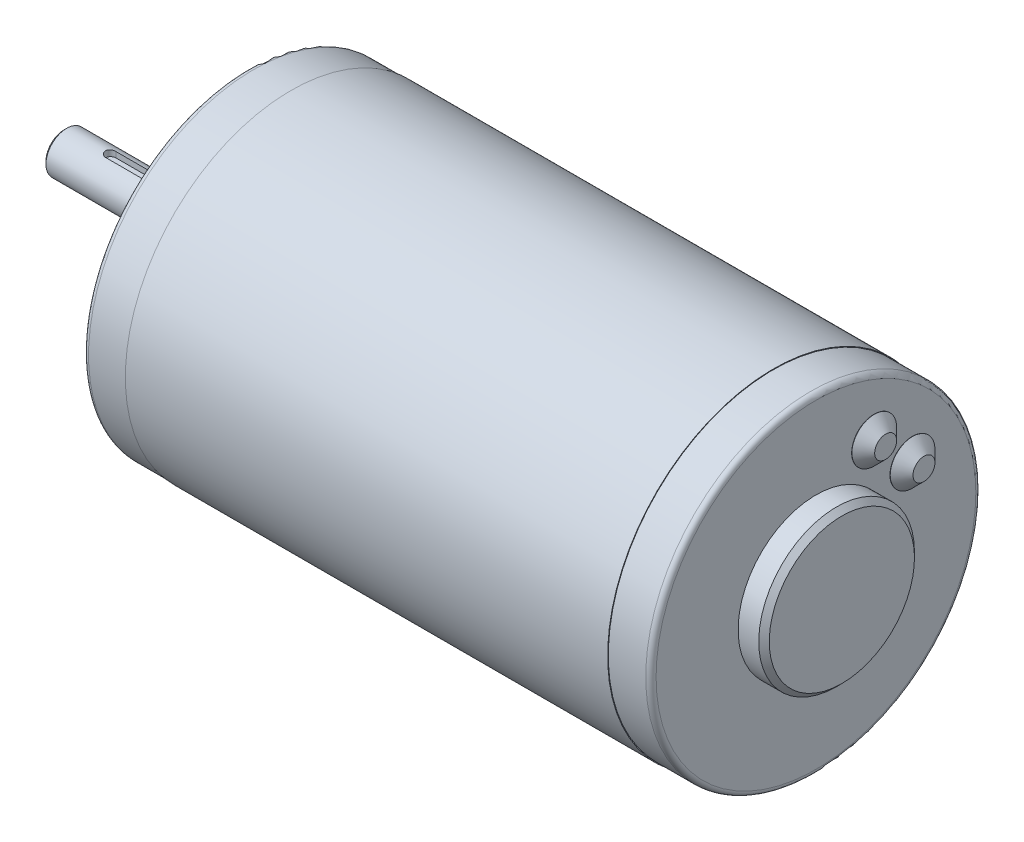
ISO-10303-21;
HEADER;
FILE_DESCRIPTION(('STEP AP214'),'2;1');
FILE_NAME('part.step','',(''),(''),'','','');
FILE_SCHEMA(('AUTOMOTIVE_DESIGN { 1 0 10303 214 1 1 1 1 }'));
ENDSEC;
DATA;
#1=APPLICATION_CONTEXT('core data for automotive mechanical design processes');
#2=APPLICATION_PROTOCOL_DEFINITION('international standard','automotive_design',2000,#1);
#3=PRODUCT_CONTEXT('',#1,'mechanical');
#4=PRODUCT('Part','Part','',(#3));
#5=PRODUCT_RELATED_PRODUCT_CATEGORY('part','',(#4));
#6=PRODUCT_DEFINITION_FORMATION('','',#4);
#7=PRODUCT_DEFINITION_CONTEXT('part definition',#1,'design');
#8=PRODUCT_DEFINITION('design','',#6,#7);
#9=PRODUCT_DEFINITION_SHAPE('','',#8);
#10=(LENGTH_UNIT() NAMED_UNIT(*) SI_UNIT(.MILLI.,.METRE.));
#11=(NAMED_UNIT(*) PLANE_ANGLE_UNIT() SI_UNIT($,.RADIAN.));
#12=(NAMED_UNIT(*) SI_UNIT($,.STERADIAN.) SOLID_ANGLE_UNIT());
#13=UNCERTAINTY_MEASURE_WITH_UNIT(LENGTH_MEASURE(1.E-05),#10,'distance_accuracy_value','');
#14=(GEOMETRIC_REPRESENTATION_CONTEXT(3) GLOBAL_UNCERTAINTY_ASSIGNED_CONTEXT((#13)) GLOBAL_UNIT_ASSIGNED_CONTEXT((#10,
#11,#12)) REPRESENTATION_CONTEXT('',''));
#15=CARTESIAN_POINT('',(0.,0.,0.));
#16=DIRECTION('',(0.,0.,1.));
#17=DIRECTION('',(1.,0.,0.));
#18=AXIS2_PLACEMENT_3D('',#15,#16,#17);
#19=CARTESIAN_POINT('',(-27.6,2.79999999999999,-1.));
#20=DIRECTION('',(0.,-1.,0.));
#21=DIRECTION('',(0.,0.,-1.));
#22=AXIS2_PLACEMENT_3D('',#19,#20,#21);
#23=PLANE('',#22);
#24=CARTESIAN_POINT('',(-7.1,2.79999999999999,0.));
#25=DIRECTION('',(0.,1.,0.));
#26=DIRECTION('',(0.,0.,1.));
#27=AXIS2_PLACEMENT_3D('',#24,#25,#26);
#28=CIRCLE('',#27,1.);
#29=CARTESIAN_POINT('',(-7.1,2.79999999999999,1.));
#30=VERTEX_POINT('',#29);
#31=CARTESIAN_POINT('',(-7.1,2.79999999999999,-1.));
#32=VERTEX_POINT('',#31);
#33=EDGE_CURVE('E80',#30,#32,#28,.T.);
#34=ORIENTED_EDGE('',*,*,#33,.T.);
#35=DIRECTION('',(1.,0.,0.));
#36=VECTOR('',#35,1.);
#37=CARTESIAN_POINT('',(-27.6,2.79999999999999,-1.));
#38=LINE('',#37,#36);
#39=CARTESIAN_POINT('',(-26.6,2.79999999999999,-1.));
#40=VERTEX_POINT('',#39);
#41=EDGE_CURVE('E75',#40,#32,#38,.T.);
#42=ORIENTED_EDGE('',*,*,#41,.F.);
#43=CARTESIAN_POINT('',(-26.6,2.79999999999999,0.));
#44=DIRECTION('',(0.,-1.,0.));
#45=DIRECTION('',(0.,0.,-1.));
#46=AXIS2_PLACEMENT_3D('',#43,#44,#45);
#47=CIRCLE('',#46,1.);
#48=CARTESIAN_POINT('',(-26.6,2.79999999999999,1.));
#49=VERTEX_POINT('',#48);
#50=EDGE_CURVE('E77',#40,#49,#47,.F.);
#51=ORIENTED_EDGE('',*,*,#50,.T.);
#52=DIRECTION('',(1.,0.,0.));
#53=VECTOR('',#52,1.);
#54=CARTESIAN_POINT('',(-27.6,2.79999999999999,1.));
#55=LINE('',#54,#53);
#56=EDGE_CURVE('E103',#49,#30,#55,.T.);
#57=ORIENTED_EDGE('',*,*,#56,.T.);
#58=EDGE_LOOP('',(#34,#42,#51,#57));
#59=FACE_BOUND('',#58,.T.);
#60=ADVANCED_FACE('F17',(#59),#23,.F.);
#61=CARTESIAN_POINT('',(-35.6,0.,0.));
#62=DIRECTION('',(-1.,0.,0.));
#63=DIRECTION('',(0.,0.,1.));
#64=AXIS2_PLACEMENT_3D('',#61,#62,#63);
#65=PLANE('',#64);
#66=CARTESIAN_POINT('',(-35.6000000000449,0.,0.));
#67=DIRECTION('',(1.,0.,0.));
#68=DIRECTION('',(0.,0.,-1.));
#69=AXIS2_PLACEMENT_3D('',#66,#67,#68);
#70=CIRCLE('',#69,3.49999999997408);
#71=CARTESIAN_POINT('',(-35.6000000000449,0.,-3.49999999997408));
#72=VERTEX_POINT('',#71);
#73=EDGE_CURVE('E325',#72,#72,#70,.T.);
#74=ORIENTED_EDGE('',*,*,#73,.F.);
#75=EDGE_LOOP('',(#74));
#76=FACE_BOUND('',#75,.T.);
#77=ADVANCED_FACE('F663',(#76),#65,.T.);
#78=CARTESIAN_POINT('',(-26.6,3.87298334620741,0.));
#79=DIRECTION('',(0.,-1.,0.));
#80=DIRECTION('',(0.,0.,-1.));
#81=AXIS2_PLACEMENT_3D('',#78,#79,#80);
#82=CYLINDRICAL_SURFACE('',#81,1.);
#83=CARTESIAN_POINT('',(-26.6,3.87298334620741,1.));
#84=CARTESIAN_POINT('',(-26.6276629851065,3.87298148580177,1.00000033749611));
#85=CARTESIAN_POINT('',(-26.6553122630182,3.8732800994947,0.998851407375366));
#86=CARTESIAN_POINT('',(-26.7104040353036,3.87445904774558,0.994271295395754));
#87=CARTESIAN_POINT('',(-26.7378465636871,3.87533928441687,0.990840497572679));
#88=CARTESIAN_POINT('',(-26.8194531732088,3.87881710972053,0.977175239382526));
#89=CARTESIAN_POINT('',(-26.8730564684822,3.88225203148808,0.963567695172493));
#90=CARTESIAN_POINT('',(-26.977124673782,3.89095422588002,0.927798076247996));
#91=CARTESIAN_POINT('',(-27.0275898782129,3.89622132630929,0.905636805423835));
#92=CARTESIAN_POINT('',(-27.1241114486473,3.90799134471939,0.853415378025864));
#93=CARTESIAN_POINT('',(-27.170166627891,3.91449459395647,0.823353103356932));
#94=CARTESIAN_POINT('',(-27.2575438819061,3.92816262398025,0.755484471828069));
#95=CARTESIAN_POINT('',(-27.2987548862455,3.93533791028915,0.717537268783975));
#96=CARTESIAN_POINT('',(-27.3743020894827,3.94945104396193,0.635275780516229));
#97=CARTESIAN_POINT('',(-27.4086371894679,3.95638885322537,0.59096047947883));
#98=CARTESIAN_POINT('',(-27.4699110016186,3.96936182283248,0.496456899401689));
#99=CARTESIAN_POINT('',(-27.496739895984,3.9753830468173,0.446195340334472));
#100=CARTESIAN_POINT('',(-27.5415247341967,3.98572346250588,0.341702590842916));
#101=CARTESIAN_POINT('',(-27.5594824242998,3.990042989147,0.287472184083007));
#102=CARTESIAN_POINT('',(-27.5856589927774,3.99641900005128,0.177744108525158));
#103=CARTESIAN_POINT('',(-27.5940676724228,3.998519529013,0.122294322002856));
#104=CARTESIAN_POINT('',(-27.6015033715433,4.00037438150815,0.0107327756816781));
#105=CARTESIAN_POINT('',(-27.6005315701923,4.00012899993444,-0.0453789000287067));
#106=CARTESIAN_POINT('',(-27.5893700363146,3.99735237365735,-0.155352492972096));
#107=CARTESIAN_POINT('',(-27.5793853834005,3.9948719867736,-0.209236701739855));
#108=CARTESIAN_POINT('',(-27.5508113208173,3.98796330636495,-0.31453871108434));
#109=CARTESIAN_POINT('',(-27.5322215304314,3.98353492665556,-0.365956402423988));
#110=CARTESIAN_POINT('',(-27.4867987193294,3.97314997761798,-0.46540728602454));
#111=CARTESIAN_POINT('',(-27.4598926057672,3.96717993827555,-0.513405629602248));
#112=CARTESIAN_POINT('',(-27.3986568701665,3.95435945541919,-0.604276631230015));
#113=CARTESIAN_POINT('',(-27.3643261297468,3.94750887933198,-0.64714851556229));
#114=CARTESIAN_POINT('',(-27.2881210879187,3.93345566022865,-0.727769389708492));
#115=CARTESIAN_POINT('',(-27.2460683634602,3.92624850477685,-0.765349103054128));
#116=CARTESIAN_POINT('',(-27.1561701330723,3.91246168284006,-0.832969575186237));
#117=CARTESIAN_POINT('',(-27.1083230467164,3.90588218842993,-0.863008270245062));
#118=CARTESIAN_POINT('',(-27.0078544021762,3.89407813586325,-0.914804709285961));
#119=CARTESIAN_POINT('',(-26.9552085351039,3.88886106009136,-0.936517017887269));
#120=CARTESIAN_POINT('',(-26.8468830715817,3.88047058807054,-0.970702351849828));
#121=CARTESIAN_POINT('',(-26.7912081448502,3.87729413761435,-0.983189189212131));
#122=CARTESIAN_POINT('',(-26.7125426192411,3.87455290681524,-0.993904635150938));
#123=CARTESIAN_POINT('',(-26.6900802967868,3.87396523110859,-0.996190790966708));
#124=CARTESIAN_POINT('',(-26.6450822100907,3.87318062488974,-0.999236757697394));
#125=CARTESIAN_POINT('',(-26.6225466240447,3.87298306219461,-0.999999038096045));
#126=CARTESIAN_POINT('',(-26.6,3.87298334620741,-1.));
#127=B_SPLINE_CURVE_WITH_KNOTS('',3,(#83,#84,#85,#86,#87,#88,#89,#90,#91,#92,#93,#94,#95,#96,
#97,#98,#99,#100,#101,#102,#103,#104,#105,#106,#107,#108,#109,#110,#111,#112,#113,#114,#115,
#116,#117,#118,#119,#120,#121,#122,#123,#124,#125,#126),.UNSPECIFIED.,.F.,.F.,(4,2,2,2,2,2,2,2,
2,2,2,2,2,2,2,2,2,2,2,2,2,4),(0.,0.0829365303397727,0.165859106084653,0.331229963080318,
0.496585282091499,0.661984974726751,0.830641897427976,0.999325753539196,1.17036187098235,
1.34136430732425,1.50890481515325,1.67642426256639,1.84022545479276,2.00403389475838,
2.16932509450376,2.33464120964329,2.50441429534542,2.67423379180967,2.84496720161068,
3.01544447539986,3.08315848722649,3.15076267731671),.UNSPECIFIED.);
#128=CARTESIAN_POINT('',(-26.6,3.87298334620741,1.));
#129=VERTEX_POINT('',#128);
#130=CARTESIAN_POINT('',(-26.6,3.87298334620741,-1.));
#131=VERTEX_POINT('',#130);
#132=EDGE_CURVE('E161',#129,#131,#127,.T.);
#133=ORIENTED_EDGE('',*,*,#132,.F.);
#134=DIRECTION('',(0.,1.,0.));
#135=VECTOR('',#134,1.);
#136=CARTESIAN_POINT('',(-26.6,2.79999999999999,1.));
#137=LINE('',#136,#135);
#138=EDGE_CURVE('E90',#129,#49,#137,.F.);
#139=ORIENTED_EDGE('',*,*,#138,.T.);
#140=ORIENTED_EDGE('',*,*,#50,.F.);
#141=DIRECTION('',(0.,1.,0.));
#142=VECTOR('',#141,1.);
#143=CARTESIAN_POINT('',(-26.6,2.79999999999999,-1.));
#144=LINE('',#143,#142);
#145=EDGE_CURVE('E84',#131,#40,#144,.F.);
#146=ORIENTED_EDGE('',*,*,#145,.F.);
#147=EDGE_LOOP('',(#133,#139,#140,#146));
#148=FACE_BOUND('',#147,.T.);
#149=ADVANCED_FACE('F87',(#148),#82,.F.);
#150=CARTESIAN_POINT('',(-27.6,2.79999999999999,-1.));
#151=DIRECTION('',(0.,0.,1.));
#152=DIRECTION('',(1.,0.,0.));
#153=AXIS2_PLACEMENT_3D('',#150,#151,#152);
#154=PLANE('',#153);
#155=DIRECTION('',(1.,0.,0.));
#156=VECTOR('',#155,1.);
#157=CARTESIAN_POINT('',(0.,3.87298334620741,-1.));
#158=LINE('',#157,#156);
#159=CARTESIAN_POINT('',(-7.1,3.87298334620741,-1.));
#160=VERTEX_POINT('',#159);
#161=EDGE_CURVE('E95',#131,#160,#158,.T.);
#162=ORIENTED_EDGE('',*,*,#161,.F.);
#163=ORIENTED_EDGE('',*,*,#145,.T.);
#164=ORIENTED_EDGE('',*,*,#41,.T.);
#165=DIRECTION('',(0.,1.,0.));
#166=VECTOR('',#165,1.);
#167=CARTESIAN_POINT('',(-7.1,2.79999999999999,-1.));
#168=LINE('',#167,#166);
#169=EDGE_CURVE('E98',#32,#160,#168,.T.);
#170=ORIENTED_EDGE('',*,*,#169,.T.);
#171=EDGE_LOOP('',(#162,#163,#164,#170));
#172=FACE_BOUND('',#171,.T.);
#173=ADVANCED_FACE('F93',(#172),#154,.T.);
#174=CARTESIAN_POINT('',(-7.1,2.79999999999999,0.));
#175=DIRECTION('',(0.,1.,0.));
#176=DIRECTION('',(0.,0.,1.));
#177=AXIS2_PLACEMENT_3D('',#174,#175,#176);
#178=CYLINDRICAL_SURFACE('',#177,1.);
#179=ORIENTED_EDGE('',*,*,#33,.F.);
#180=DIRECTION('',(0.,1.,0.));
#181=VECTOR('',#180,1.);
#182=CARTESIAN_POINT('',(-7.1,2.79999999999999,1.));
#183=LINE('',#182,#181);
#184=CARTESIAN_POINT('',(-7.1,3.87298334620741,1.));
#185=VERTEX_POINT('',#184);
#186=EDGE_CURVE('E104',#30,#185,#183,.T.);
#187=ORIENTED_EDGE('',*,*,#186,.T.);
#188=CARTESIAN_POINT('',(-7.1,3.87298334620741,-1.));
#189=CARTESIAN_POINT('',(-7.07233701489346,3.87298148580177,-1.00000033749611));
#190=CARTESIAN_POINT('',(-7.04468773698177,3.8732800994947,-0.998851407375366));
#191=CARTESIAN_POINT('',(-6.98959596469644,3.87445904774558,-0.994271295395754));
#192=CARTESIAN_POINT('',(-6.96215343631291,3.87533928441687,-0.990840497572679));
#193=CARTESIAN_POINT('',(-6.88054682679116,3.87881710972053,-0.977175239382526));
#194=CARTESIAN_POINT('',(-6.82694353151779,3.88225203148808,-0.963567695172493));
#195=CARTESIAN_POINT('',(-6.72287532621804,3.89095422588002,-0.927798076247997));
#196=CARTESIAN_POINT('',(-6.67241012178714,3.89622132630929,-0.905636805423836));
#197=CARTESIAN_POINT('',(-6.57588855135267,3.90799134471939,-0.853415378025865));
#198=CARTESIAN_POINT('',(-6.52983337210904,3.91449459395647,-0.823353103356933));
#199=CARTESIAN_POINT('',(-6.4424561180939,3.92816262398025,-0.755484471828069));
#200=CARTESIAN_POINT('',(-6.40124511375448,3.93533791028915,-0.717537268783976));
#201=CARTESIAN_POINT('',(-6.32569791051729,3.94945104396193,-0.63527578051623));
#202=CARTESIAN_POINT('',(-6.29136281053206,3.95638885322537,-0.590960479478831));
#203=CARTESIAN_POINT('',(-6.23008899838136,3.96936182283248,-0.496456899401691));
#204=CARTESIAN_POINT('',(-6.20326010401603,3.9753830468173,-0.446195340334474));
#205=CARTESIAN_POINT('',(-6.1584752658033,3.98572346250588,-0.341702590842919));
#206=CARTESIAN_POINT('',(-6.14051757570017,3.990042989147,-0.28747218408301));
#207=CARTESIAN_POINT('',(-6.11434100722257,3.99641900005128,-0.17774410852516));
#208=CARTESIAN_POINT('',(-6.10593232757718,3.998519529013,-0.122294322002858));
#209=CARTESIAN_POINT('',(-6.09849662845671,4.00037438150815,-0.0107327756816796));
#210=CARTESIAN_POINT('',(-6.09946842980766,4.00012899993444,0.0453789000287057));
#211=CARTESIAN_POINT('',(-6.11062996368545,3.99735237365735,0.155352492972096));
#212=CARTESIAN_POINT('',(-6.12061461659948,3.9948719867736,0.209236701739855));
#213=CARTESIAN_POINT('',(-6.14918867918275,3.98796330636495,0.31453871108434));
#214=CARTESIAN_POINT('',(-6.16777846956858,3.98353492665556,0.365956402423988));
#215=CARTESIAN_POINT('',(-6.21320128067065,3.97314997761798,0.465407286024539));
#216=CARTESIAN_POINT('',(-6.24010739423284,3.96717993827555,0.513405629602248));
#217=CARTESIAN_POINT('',(-6.30134312983347,3.95435945541919,0.604276631230014));
#218=CARTESIAN_POINT('',(-6.33567387025322,3.94750887933198,0.647148515562289));
#219=CARTESIAN_POINT('',(-6.41187891208131,3.93345566022865,0.72776938970849));
#220=CARTESIAN_POINT('',(-6.45393163653981,3.92624850477685,0.765349103054127));
#221=CARTESIAN_POINT('',(-6.54382986692773,3.91246168284006,0.832969575186237));
#222=CARTESIAN_POINT('',(-6.59167695328356,3.90588218842993,0.863008270245062));
#223=CARTESIAN_POINT('',(-6.69214559782377,3.89407813586325,0.914804709285962));
#224=CARTESIAN_POINT('',(-6.74479146489609,3.88886106009136,0.936517017887269));
#225=CARTESIAN_POINT('',(-6.85311692841829,3.88047058807055,0.970702351849829));
#226=CARTESIAN_POINT('',(-6.90879185514984,3.87729413761435,0.983189189212132));
#227=CARTESIAN_POINT('',(-6.9874573807589,3.87455290681524,0.993904635150938));
#228=CARTESIAN_POINT('',(-7.00991970321318,3.87396523110859,0.996190790966708));
#229=CARTESIAN_POINT('',(-7.05491778990932,3.87318062488974,0.999236757697394));
#230=CARTESIAN_POINT('',(-7.07745337595529,3.87298306219461,0.999999038096045));
#231=CARTESIAN_POINT('',(-7.1,3.87298334620741,1.));
#232=B_SPLINE_CURVE_WITH_KNOTS('',3,(#188,#189,#190,#191,#192,#193,#194,#195,#196,#197,#198,
#199,#200,#201,#202,#203,#204,#205,#206,#207,#208,#209,#210,#211,#212,#213,#214,#215,#216,#217,
#218,#219,#220,#221,#222,#223,#224,#225,#226,#227,#228,#229,#230,#231),.UNSPECIFIED.,.F.,.F.,(4,
2,2,2,2,2,2,2,2,2,2,2,2,2,2,2,2,2,2,2,2,4),(0.,0.0829365303397693,0.165859106084651,
0.331229963080317,0.496585282091498,0.661984974726749,0.830641897427974,0.999325753539193,
1.17036187098235,1.34136430732424,1.50890481515325,1.67642426256639,1.84022545479276,
2.00403389475838,2.16932509450376,2.33464120964329,2.50441429534542,2.67423379180967,
2.84496720161068,3.01544447539986,3.08315848722648,3.15076267731671),.UNSPECIFIED.);
#233=EDGE_CURVE('E152',#160,#185,#232,.T.);
#234=ORIENTED_EDGE('',*,*,#233,.F.);
#235=ORIENTED_EDGE('',*,*,#169,.F.);
#236=EDGE_LOOP('',(#179,#187,#234,#235));
#237=FACE_BOUND('',#236,.T.);
#238=ADVANCED_FACE('F167',(#237),#178,.F.);
#239=CARTESIAN_POINT('',(-27.6,2.79999999999999,1.));
#240=DIRECTION('',(0.,0.,1.));
#241=DIRECTION('',(1.,0.,0.));
#242=AXIS2_PLACEMENT_3D('',#239,#240,#241);
#243=PLANE('',#242);
#244=ORIENTED_EDGE('',*,*,#186,.F.);
#245=ORIENTED_EDGE('',*,*,#56,.F.);
#246=ORIENTED_EDGE('',*,*,#138,.F.);
#247=DIRECTION('',(1.,0.,0.));
#248=VECTOR('',#247,1.);
#249=CARTESIAN_POINT('',(0.,3.87298334620741,1.));
#250=LINE('',#249,#248);
#251=EDGE_CURVE('E160',#185,#129,#250,.F.);
#252=ORIENTED_EDGE('',*,*,#251,.F.);
#253=EDGE_LOOP('',(#244,#245,#246,#252));
#254=FACE_BOUND('',#253,.T.);
#255=ADVANCED_FACE('F182',(#254),#243,.F.);
#256=CARTESIAN_POINT('',(-35.0999999999999,0.,0.));
#257=DIRECTION('',(1.,0.,0.));
#258=DIRECTION('',(0.,0.,-1.));
#259=AXIS2_PLACEMENT_3D('',#256,#257,#258);
#260=CONICAL_SURFACE('',#259,3.99999999996226,0.785398163340605);
#261=ORIENTED_EDGE('',*,*,#73,.T.);
#262=EDGE_LOOP('',(#261));
#263=FACE_BOUND('',#262,.T.);
#264=CARTESIAN_POINT('',(-35.1,0.,0.));
#265=DIRECTION('',(1.,0.,0.));
#266=DIRECTION('',(0.,0.,-1.));
#267=AXIS2_PLACEMENT_3D('',#264,#265,#266);
#268=CIRCLE('',#267,4.);
#269=CARTESIAN_POINT('',(-35.1,0.,-4.));
#270=VERTEX_POINT('',#269);
#271=EDGE_CURVE('E151',#270,#270,#268,.T.);
#272=ORIENTED_EDGE('',*,*,#271,.F.);
#273=EDGE_LOOP('',(#272));
#274=FACE_BOUND('',#273,.T.);
#275=ADVANCED_FACE('F177',(#263,#274),#260,.T.);
#276=CARTESIAN_POINT('',(0.,0.,0.));
#277=DIRECTION('',(1.,0.,0.));
#278=DIRECTION('',(0.,0.,-1.));
#279=AXIS2_PLACEMENT_3D('',#276,#277,#278);
#280=CYLINDRICAL_SURFACE('',#279,4.);
#281=ORIENTED_EDGE('',*,*,#271,.T.);
#282=EDGE_LOOP('',(#281));
#283=FACE_BOUND('',#282,.T.);
#284=CARTESIAN_POINT('',(-4.,0.,0.));
#285=DIRECTION('',(1.,0.,0.));
#286=DIRECTION('',(0.,0.,-1.));
#287=AXIS2_PLACEMENT_3D('',#284,#285,#286);
#288=CIRCLE('',#287,4.);
#289=CARTESIAN_POINT('',(-4.,0.,-4.));
#290=VERTEX_POINT('',#289);
#291=EDGE_CURVE('E148',#290,#290,#288,.T.);
#292=ORIENTED_EDGE('',*,*,#291,.F.);
#293=EDGE_LOOP('',(#292));
#294=FACE_BOUND('',#293,.T.);
#295=ORIENTED_EDGE('',*,*,#233,.T.);
#296=ORIENTED_EDGE('',*,*,#251,.T.);
#297=ORIENTED_EDGE('',*,*,#132,.T.);
#298=ORIENTED_EDGE('',*,*,#161,.T.);
#299=EDGE_LOOP('',(#295,#296,#297,#298));
#300=FACE_BOUND('',#299,.T.);
#301=ADVANCED_FACE('F171',(#283,#294,#300),#280,.T.);
#302=CARTESIAN_POINT('',(-4.,4.,0.));
#303=DIRECTION('',(-1.,0.,0.));
#304=DIRECTION('',(0.,0.,1.));
#305=AXIS2_PLACEMENT_3D('',#302,#303,#304);
#306=PLANE('',#305);
#307=ORIENTED_EDGE('',*,*,#291,.T.);
#308=EDGE_LOOP('',(#307));
#309=FACE_BOUND('',#308,.T.);
#310=CARTESIAN_POINT('',(-4.,0.,0.));
#311=DIRECTION('',(1.,0.,0.));
#312=DIRECTION('',(0.,1.,0.));
#313=AXIS2_PLACEMENT_3D('',#310,#311,#312);
#314=CIRCLE('',#313,8.509);
#315=CARTESIAN_POINT('',(-4.,8.509,0.));
#316=VERTEX_POINT('',#315);
#317=EDGE_CURVE('E145',#316,#316,#314,.T.);
#318=ORIENTED_EDGE('',*,*,#317,.F.);
#319=EDGE_LOOP('',(#318));
#320=FACE_BOUND('',#319,.T.);
#321=ADVANCED_FACE('F176',(#309,#320),#306,.T.);
#322=CARTESIAN_POINT('',(111.8479,18.6070906828553,-11.2073596390943));
#323=DIRECTION('',(1.,0.,0.));
#324=DIRECTION('',(0.,0.,-1.));
#325=AXIS2_PLACEMENT_3D('',#322,#323,#324);
#326=PLANE('',#325);
#327=CARTESIAN_POINT('',(111.84789999993,18.6070906828553,-11.2073596390943));
#328=DIRECTION('',(-1.,0.,0.));
#329=DIRECTION('',(0.,-1.,0.));
#330=AXIS2_PLACEMENT_3D('',#327,#328,#329);
#331=CIRCLE('',#330,2.11800000003146);
#332=CARTESIAN_POINT('',(111.84789999993,16.4890906828238,-11.2073596390943));
#333=VERTEX_POINT('',#332);
#334=EDGE_CURVE('E142',#333,#333,#331,.T.);
#335=ORIENTED_EDGE('',*,*,#334,.F.);
#336=EDGE_LOOP('',(#335));
#337=FACE_BOUND('',#336,.T.);
#338=ADVANCED_FACE('F465',(#337),#326,.T.);
#339=CARTESIAN_POINT('',(114.6,15.0368,0.));
#340=DIRECTION('',(1.,0.,0.));
#341=DIRECTION('',(0.,0.,-1.));
#342=AXIS2_PLACEMENT_3D('',#339,#340,#341);
#343=PLANE('',#342);
#344=CARTESIAN_POINT('',(114.6,0.,0.));
#345=DIRECTION('',(-1.,0.,0.));
#346=DIRECTION('',(0.,-1.,0.));
#347=AXIS2_PLACEMENT_3D('',#344,#345,#346);
#348=CIRCLE('',#347,14.0208);
#349=CARTESIAN_POINT('',(114.6,-14.0208,0.));
#350=VERTEX_POINT('',#349);
#351=EDGE_CURVE('E139',#350,#350,#348,.T.);
#352=ORIENTED_EDGE('',*,*,#351,.F.);
#353=EDGE_LOOP('',(#352));
#354=FACE_BOUND('',#353,.T.);
#355=ADVANCED_FACE('F455',(#354),#343,.T.);
#356=CARTESIAN_POINT('',(111.8479,11.2073596390943,-18.6070906828553));
#357=DIRECTION('',(1.,0.,0.));
#358=DIRECTION('',(0.,0.,-1.));
#359=AXIS2_PLACEMENT_3D('',#356,#357,#358);
#360=PLANE('',#359);
#361=CARTESIAN_POINT('',(111.84789999993,11.2073596390943,-18.6070906828553));
#362=DIRECTION('',(-1.,0.,0.));
#363=DIRECTION('',(0.,0.,1.));
#364=AXIS2_PLACEMENT_3D('',#361,#362,#363);
#365=CIRCLE('',#364,2.1180000000021);
#366=CARTESIAN_POINT('',(111.84789999993,11.2073596390943,-16.4890906828532));
#367=VERTEX_POINT('',#366);
#368=EDGE_CURVE('E135',#367,#367,#365,.T.);
#369=ORIENTED_EDGE('',*,*,#368,.F.);
#370=EDGE_LOOP('',(#369));
#371=FACE_BOUND('',#370,.T.);
#372=ADVANCED_FACE('F448',(#371),#360,.T.);
#373=CARTESIAN_POINT('',(13.6143999999945,25.4,0.));
#374=DIRECTION('',(-1.,0.,0.));
#375=DIRECTION('',(0.,0.,1.));
#376=AXIS2_PLACEMENT_3D('',#373,#374,#375);
#377=CONICAL_SURFACE('',#376,2.01929999997219,1.02974425867198);
#378=CARTESIAN_POINT('',(14.827717847993,25.4,0.));
#379=VERTEX_POINT('',#378);
#380=VERTEX_LOOP('',#379);
#381=FACE_BOUND('',#380,.T.);
#382=CARTESIAN_POINT('',(13.6144,25.4,0.));
#383=DIRECTION('',(-1.,0.,0.));
#384=DIRECTION('',(0.,0.,1.));
#385=AXIS2_PLACEMENT_3D('',#382,#383,#384);
#386=CIRCLE('',#385,2.0193);
#387=CARTESIAN_POINT('',(13.6144,25.4,2.0193));
#388=VERTEX_POINT('',#387);
#389=EDGE_CURVE('E138',#388,#388,#386,.T.);
#390=ORIENTED_EDGE('',*,*,#389,.T.);
#391=EDGE_LOOP('',(#390));
#392=FACE_BOUND('',#391,.T.);
#393=ADVANCED_FACE('F454',(#381,#392),#377,.F.);
#394=CARTESIAN_POINT('',(13.6143999999945,-25.4,0.));
#395=DIRECTION('',(-1.,0.,0.));
#396=DIRECTION('',(0.,0.,1.));
#397=AXIS2_PLACEMENT_3D('',#394,#395,#396);
#398=CONICAL_SURFACE('',#397,2.01929999997219,1.02974425867198);
#399=CARTESIAN_POINT('',(14.827717847993,-25.4,0.));
#400=VERTEX_POINT('',#399);
#401=VERTEX_LOOP('',#400);
#402=FACE_BOUND('',#401,.T.);
#403=CARTESIAN_POINT('',(13.6144,-25.4,0.));
#404=DIRECTION('',(-1.,0.,0.));
#405=DIRECTION('',(0.,0.,1.));
#406=AXIS2_PLACEMENT_3D('',#403,#404,#405);
#407=CIRCLE('',#406,2.0193);
#408=CARTESIAN_POINT('',(13.6144,-25.4,2.0193));
#409=VERTEX_POINT('',#408);
#410=EDGE_CURVE('E315',#409,#409,#407,.T.);
#411=ORIENTED_EDGE('',*,*,#410,.T.);
#412=EDGE_LOOP('',(#411));
#413=FACE_BOUND('',#412,.T.);
#414=ADVANCED_FACE('F516',(#402,#413),#398,.F.);
#415=CARTESIAN_POINT('',(-2.984,0.,0.));
#416=DIRECTION('',(1.,0.,0.));
#417=DIRECTION('',(0.,1.,0.));
#418=AXIS2_PLACEMENT_3D('',#415,#416,#417);
#419=CONICAL_SURFACE('',#418,9.525,0.78539816339745);
#420=ORIENTED_EDGE('',*,*,#317,.T.);
#421=EDGE_LOOP('',(#420));
#422=FACE_BOUND('',#421,.T.);
#423=CARTESIAN_POINT('',(-2.984,0.,0.));
#424=DIRECTION('',(1.,0.,0.));
#425=DIRECTION('',(0.,0.,-1.));
#426=AXIS2_PLACEMENT_3D('',#423,#424,#425);
#427=CIRCLE('',#426,9.525);
#428=CARTESIAN_POINT('',(-2.984,0.,-9.525));
#429=VERTEX_POINT('',#428);
#430=EDGE_CURVE('E312',#429,#429,#427,.T.);
#431=ORIENTED_EDGE('',*,*,#430,.F.);
#432=EDGE_LOOP('',(#431));
#433=FACE_BOUND('',#432,.T.);
#434=ADVANCED_FACE('F440',(#422,#433),#419,.T.);
#435=CARTESIAN_POINT('',(109.647900000027,18.6070906828553,-11.2073596390943));
#436=DIRECTION('',(-1.,0.,0.));
#437=DIRECTION('',(0.,-1.,0.));
#438=AXIS2_PLACEMENT_3D('',#435,#436,#437);
#439=CONICAL_SURFACE('',#438,4.31799999987712,0.785398163384529);
#440=CARTESIAN_POINT('',(109.6479,18.6070906828553,-11.2073596390943));
#441=DIRECTION('',(-1.,0.,0.));
#442=DIRECTION('',(0.,0.,1.));
#443=AXIS2_PLACEMENT_3D('',#440,#441,#442);
#444=CIRCLE('',#443,4.318);
#445=CARTESIAN_POINT('',(109.6479,18.6070906828553,-6.88935963909434));
#446=VERTEX_POINT('',#445);
#447=EDGE_CURVE('E309',#446,#446,#444,.T.);
#448=ORIENTED_EDGE('',*,*,#447,.F.);
#449=EDGE_LOOP('',(#448));
#450=FACE_BOUND('',#449,.T.);
#451=ORIENTED_EDGE('',*,*,#334,.T.);
#452=EDGE_LOOP('',(#451));
#453=FACE_BOUND('',#452,.T.);
#454=ADVANCED_FACE('F434',(#450,#453),#439,.T.);
#455=CARTESIAN_POINT('',(113.584,0.,0.));
#456=DIRECTION('',(-1.,0.,0.));
#457=DIRECTION('',(0.,-1.,0.));
#458=AXIS2_PLACEMENT_3D('',#455,#456,#457);
#459=CONICAL_SURFACE('',#458,15.0368,0.785398163397441);
#460=ORIENTED_EDGE('',*,*,#351,.T.);
#461=EDGE_LOOP('',(#460));
#462=FACE_BOUND('',#461,.T.);
#463=CARTESIAN_POINT('',(113.584,0.,0.));
#464=DIRECTION('',(1.,0.,0.));
#465=DIRECTION('',(0.,0.,-1.));
#466=AXIS2_PLACEMENT_3D('',#463,#464,#465);
#467=CIRCLE('',#466,15.0368);
#468=CARTESIAN_POINT('',(113.584,0.,-15.0368));
#469=VERTEX_POINT('',#468);
#470=EDGE_CURVE('E306',#469,#469,#467,.F.);
#471=ORIENTED_EDGE('',*,*,#470,.F.);
#472=EDGE_LOOP('',(#471));
#473=FACE_BOUND('',#472,.T.);
#474=ADVANCED_FACE('F424',(#462,#473),#459,.T.);
#475=CARTESIAN_POINT('',(109.647900000084,11.2073596390943,-18.6070906828553));
#476=DIRECTION('',(-1.,0.,0.));
#477=DIRECTION('',(0.,0.,1.));
#478=AXIS2_PLACEMENT_3D('',#475,#476,#477);
#479=CONICAL_SURFACE('',#478,4.31799999990461,0.785398163410367);
#480=CARTESIAN_POINT('',(109.6479,11.2073596390943,-18.6070906828553));
#481=DIRECTION('',(-1.,0.,0.));
#482=DIRECTION('',(0.,0.,1.));
#483=AXIS2_PLACEMENT_3D('',#480,#481,#482);
#484=CIRCLE('',#483,4.318);
#485=CARTESIAN_POINT('',(109.6479,11.2073596390943,-14.2890906828553));
#486=VERTEX_POINT('',#485);
#487=EDGE_CURVE('E134',#486,#486,#484,.T.);
#488=ORIENTED_EDGE('',*,*,#487,.F.);
#489=EDGE_LOOP('',(#488));
#490=FACE_BOUND('',#489,.T.);
#491=ORIENTED_EDGE('',*,*,#368,.T.);
#492=EDGE_LOOP('',(#491));
#493=FACE_BOUND('',#492,.T.);
#494=ADVANCED_FACE('F417',(#490,#493),#479,.T.);
#495=CARTESIAN_POINT('',(0.,25.4,0.));
#496=DIRECTION('',(-1.,0.,0.));
#497=DIRECTION('',(0.,0.,1.));
#498=AXIS2_PLACEMENT_3D('',#495,#496,#497);
#499=CYLINDRICAL_SURFACE('',#498,2.0193);
#500=CARTESIAN_POINT('',(0.,25.4,0.));
#501=DIRECTION('',(-1.,0.,0.));
#502=DIRECTION('',(0.,0.,1.));
#503=AXIS2_PLACEMENT_3D('',#500,#501,#502);
#504=CIRCLE('',#503,2.0193);
#505=CARTESIAN_POINT('',(0.,25.4,2.0193));
#506=VERTEX_POINT('',#505);
#507=EDGE_CURVE('E131',#506,#506,#504,.F.);
#508=ORIENTED_EDGE('',*,*,#507,.F.);
#509=EDGE_LOOP('',(#508));
#510=FACE_BOUND('',#509,.T.);
#511=ORIENTED_EDGE('',*,*,#389,.F.);
#512=EDGE_LOOP('',(#511));
#513=FACE_BOUND('',#512,.T.);
#514=ADVANCED_FACE('F423',(#510,#513),#499,.F.);
#515=CARTESIAN_POINT('',(0.,-25.4,0.));
#516=DIRECTION('',(-1.,0.,0.));
#517=DIRECTION('',(0.,0.,1.));
#518=AXIS2_PLACEMENT_3D('',#515,#516,#517);
#519=CYLINDRICAL_SURFACE('',#518,2.0193);
#520=CARTESIAN_POINT('',(0.,-25.4,0.));
#521=DIRECTION('',(-1.,0.,0.));
#522=DIRECTION('',(0.,0.,1.));
#523=AXIS2_PLACEMENT_3D('',#520,#521,#522);
#524=CIRCLE('',#523,2.0193);
#525=CARTESIAN_POINT('',(0.,-25.4,2.0193));
#526=VERTEX_POINT('',#525);
#527=EDGE_CURVE('E128',#526,#526,#524,.F.);
#528=ORIENTED_EDGE('',*,*,#527,.F.);
#529=EDGE_LOOP('',(#528));
#530=FACE_BOUND('',#529,.T.);
#531=ORIENTED_EDGE('',*,*,#410,.F.);
#532=EDGE_LOOP('',(#531));
#533=FACE_BOUND('',#532,.T.);
#534=ADVANCED_FACE('F541',(#530,#533),#519,.F.);
#535=CARTESIAN_POINT('',(0.,0.,0.));
#536=DIRECTION('',(1.,0.,0.));
#537=DIRECTION('',(0.,0.,-1.));
#538=AXIS2_PLACEMENT_3D('',#535,#536,#537);
#539=CYLINDRICAL_SURFACE('',#538,9.525);
#540=ORIENTED_EDGE('',*,*,#430,.T.);
#541=EDGE_LOOP('',(#540));
#542=FACE_BOUND('',#541,.T.);
#543=CARTESIAN_POINT('',(0.,0.,0.));
#544=DIRECTION('',(1.,0.,0.));
#545=DIRECTION('',(0.,0.,-1.));
#546=AXIS2_PLACEMENT_3D('',#543,#544,#545);
#547=CIRCLE('',#546,9.525);
#548=CARTESIAN_POINT('',(0.,0.,-9.525));
#549=VERTEX_POINT('',#548);
#550=EDGE_CURVE('E125',#549,#549,#547,.T.);
#551=ORIENTED_EDGE('',*,*,#550,.F.);
#552=EDGE_LOOP('',(#551));
#553=FACE_BOUND('',#552,.T.);
#554=ADVANCED_FACE('F409',(#542,#553),#539,.T.);
#555=CARTESIAN_POINT('',(111.8479,18.6070906828553,-11.2073596390943));
#556=DIRECTION('',(-1.,0.,0.));
#557=DIRECTION('',(0.,0.,1.));
#558=AXIS2_PLACEMENT_3D('',#555,#556,#557);
#559=CYLINDRICAL_SURFACE('',#558,4.318);
#560=CARTESIAN_POINT('',(109.6,18.6070906828553,-11.2073596390943));
#561=DIRECTION('',(-1.,0.,0.));
#562=DIRECTION('',(0.,0.,1.));
#563=AXIS2_PLACEMENT_3D('',#560,#561,#562);
#564=CIRCLE('',#563,4.318);
#565=CARTESIAN_POINT('',(109.6,18.6070906828553,-6.88935963909434));
#566=VERTEX_POINT('',#565);
#567=EDGE_CURVE('E122',#566,#566,#564,.T.);
#568=ORIENTED_EDGE('',*,*,#567,.F.);
#569=EDGE_LOOP('',(#568));
#570=FACE_BOUND('',#569,.T.);
#571=ORIENTED_EDGE('',*,*,#447,.T.);
#572=EDGE_LOOP('',(#571));
#573=FACE_BOUND('',#572,.T.);
#574=ADVANCED_FACE('F403',(#570,#573),#559,.T.);
#575=CARTESIAN_POINT('',(0.,0.,0.));
#576=DIRECTION('',(1.,0.,0.));
#577=DIRECTION('',(0.,0.,-1.));
#578=AXIS2_PLACEMENT_3D('',#575,#576,#577);
#579=CYLINDRICAL_SURFACE('',#578,15.0368);
#580=CARTESIAN_POINT('',(109.6,0.,0.));
#581=DIRECTION('',(1.,0.,0.));
#582=DIRECTION('',(0.,0.,-1.));
#583=AXIS2_PLACEMENT_3D('',#580,#581,#582);
#584=CIRCLE('',#583,15.0368);
#585=CARTESIAN_POINT('',(109.6,0.,-15.0368));
#586=VERTEX_POINT('',#585);
#587=EDGE_CURVE('E119',#586,#586,#584,.F.);
#588=ORIENTED_EDGE('',*,*,#587,.F.);
#589=EDGE_LOOP('',(#588));
#590=FACE_BOUND('',#589,.T.);
#591=ORIENTED_EDGE('',*,*,#470,.T.);
#592=EDGE_LOOP('',(#591));
#593=FACE_BOUND('',#592,.T.);
#594=ADVANCED_FACE('F394',(#590,#593),#579,.T.);
#595=CARTESIAN_POINT('',(111.8479,11.2073596390943,-18.6070906828553));
#596=DIRECTION('',(-1.,0.,0.));
#597=DIRECTION('',(0.,0.,1.));
#598=AXIS2_PLACEMENT_3D('',#595,#596,#597);
#599=CYLINDRICAL_SURFACE('',#598,4.318);
#600=CARTESIAN_POINT('',(109.6,11.2073596390943,-18.6070906828553));
#601=DIRECTION('',(-1.,0.,0.));
#602=DIRECTION('',(0.,0.,1.));
#603=AXIS2_PLACEMENT_3D('',#600,#601,#602);
#604=CIRCLE('',#603,4.318);
#605=CARTESIAN_POINT('',(109.6,11.2073596390943,-14.2890906828553));
#606=VERTEX_POINT('',#605);
#607=EDGE_CURVE('E115',#606,#606,#604,.T.);
#608=ORIENTED_EDGE('',*,*,#607,.F.);
#609=EDGE_LOOP('',(#608));
#610=FACE_BOUND('',#609,.T.);
#611=ORIENTED_EDGE('',*,*,#487,.T.);
#612=EDGE_LOOP('',(#611));
#613=FACE_BOUND('',#612,.T.);
#614=ADVANCED_FACE('F388',(#610,#613),#599,.T.);
#615=CARTESIAN_POINT('',(0.,9.525,0.));
#616=DIRECTION('',(-1.,0.,0.));
#617=DIRECTION('',(0.,0.,1.));
#618=AXIS2_PLACEMENT_3D('',#615,#616,#617);
#619=PLANE('',#618);
#620=ORIENTED_EDGE('',*,*,#550,.T.);
#621=EDGE_LOOP('',(#620));
#622=FACE_BOUND('',#621,.T.);
#623=CARTESIAN_POINT('',(0.,0.,0.));
#624=DIRECTION('',(1.,0.,0.));
#625=DIRECTION('',(0.,0.,-1.));
#626=AXIS2_PLACEMENT_3D('',#623,#624,#625);
#627=CIRCLE('',#626,30.877);
#628=CARTESIAN_POINT('',(0.,0.,-30.877));
#629=VERTEX_POINT('',#628);
#630=CARTESIAN_POINT('',(0.,0.,30.877));
#631=VERTEX_POINT('',#630);
#632=EDGE_CURVE('E118',#629,#631,#627,.T.);
#633=ORIENTED_EDGE('',*,*,#632,.F.);
#634=CARTESIAN_POINT('',(0.,0.,0.));
#635=DIRECTION('',(1.,0.,0.));
#636=DIRECTION('',(0.,0.,1.));
#637=AXIS2_PLACEMENT_3D('',#634,#635,#636);
#638=CIRCLE('',#637,30.877);
#639=EDGE_CURVE('E285',#631,#629,#638,.T.);
#640=ORIENTED_EDGE('',*,*,#639,.F.);
#641=EDGE_LOOP('',(#633,#640));
#642=FACE_BOUND('',#641,.T.);
#643=ORIENTED_EDGE('',*,*,#527,.T.);
#644=EDGE_LOOP('',(#643));
#645=FACE_BOUND('',#644,.T.);
#646=ORIENTED_EDGE('',*,*,#507,.T.);
#647=EDGE_LOOP('',(#646));
#648=FACE_BOUND('',#647,.T.);
#649=ADVANCED_FACE('F251',(#622,#642,#645,#648),#619,.T.);
#650=CARTESIAN_POINT('',(109.6,31.877,0.));
#651=DIRECTION('',(1.,0.,0.));
#652=DIRECTION('',(0.,0.,-1.));
#653=AXIS2_PLACEMENT_3D('',#650,#651,#652);
#654=PLANE('',#653);
#655=ORIENTED_EDGE('',*,*,#607,.T.);
#656=EDGE_LOOP('',(#655));
#657=FACE_BOUND('',#656,.T.);
#658=ORIENTED_EDGE('',*,*,#587,.T.);
#659=EDGE_LOOP('',(#658));
#660=FACE_BOUND('',#659,.T.);
#661=CARTESIAN_POINT('',(109.6,0.,0.));
#662=DIRECTION('',(-1.,0.,0.));
#663=DIRECTION('',(0.,0.,1.));
#664=AXIS2_PLACEMENT_3D('',#661,#662,#663);
#665=CIRCLE('',#664,30.877);
#666=CARTESIAN_POINT('',(109.6,0.,30.877));
#667=VERTEX_POINT('',#666);
#668=CARTESIAN_POINT('',(109.6,0.,-30.877));
#669=VERTEX_POINT('',#668);
#670=EDGE_CURVE('E36',#667,#669,#665,.T.);
#671=ORIENTED_EDGE('',*,*,#670,.F.);
#672=CARTESIAN_POINT('',(109.6,0.,0.));
#673=DIRECTION('',(-1.,0.,0.));
#674=DIRECTION('',(0.,0.,-1.));
#675=AXIS2_PLACEMENT_3D('',#672,#673,#674);
#676=CIRCLE('',#675,30.877);
#677=EDGE_CURVE('E233',#669,#667,#676,.T.);
#678=ORIENTED_EDGE('',*,*,#677,.F.);
#679=EDGE_LOOP('',(#671,#678));
#680=FACE_BOUND('',#679,.T.);
#681=ORIENTED_EDGE('',*,*,#567,.T.);
#682=EDGE_LOOP('',(#681));
#683=FACE_BOUND('',#682,.T.);
#684=ADVANCED_FACE('F242',(#657,#660,#680,#683),#654,.T.);
#685=CARTESIAN_POINT('',(0.999999999999999,0.,0.));
#686=DIRECTION('',(-1.,0.,0.));
#687=DIRECTION('',(0.,0.,1.));
#688=AXIS2_PLACEMENT_3D('',#685,#686,#687);
#689=TOROIDAL_SURFACE('',#688,30.877,1.);
#690=CARTESIAN_POINT('',(0.999999999999999,0.,0.));
#691=DIRECTION('',(1.,0.,0.));
#692=DIRECTION('',(0.,0.,-1.));
#693=AXIS2_PLACEMENT_3D('',#690,#691,#692);
#694=CIRCLE('',#693,31.877);
#695=CARTESIAN_POINT('',(0.999999999999999,0.,-31.877));
#696=VERTEX_POINT('',#695);
#697=EDGE_CURVE('E231',#696,#696,#694,.T.);
#698=ORIENTED_EDGE('',*,*,#697,.F.);
#699=EDGE_LOOP('',(#698));
#700=FACE_BOUND('',#699,.T.);
#701=ORIENTED_EDGE('',*,*,#639,.T.);
#702=ORIENTED_EDGE('',*,*,#632,.T.);
#703=EDGE_LOOP('',(#701,#702));
#704=FACE_BOUND('',#703,.T.);
#705=ADVANCED_FACE('F220',(#700,#704),#689,.T.);
#706=CARTESIAN_POINT('',(108.6,0.,0.));
#707=DIRECTION('',(1.,0.,0.));
#708=DIRECTION('',(0.,0.,-1.));
#709=AXIS2_PLACEMENT_3D('',#706,#707,#708);
#710=TOROIDAL_SURFACE('',#709,30.877,1.);
#711=CARTESIAN_POINT('',(108.6,0.,0.));
#712=DIRECTION('',(1.,0.,0.));
#713=DIRECTION('',(0.,0.,-1.));
#714=AXIS2_PLACEMENT_3D('',#711,#712,#713);
#715=CIRCLE('',#714,31.877);
#716=CARTESIAN_POINT('',(108.6,0.,-31.877));
#717=VERTEX_POINT('',#716);
#718=EDGE_CURVE('E114',#717,#717,#715,.F.);
#719=ORIENTED_EDGE('',*,*,#718,.F.);
#720=EDGE_LOOP('',(#719));
#721=FACE_BOUND('',#720,.T.);
#722=ORIENTED_EDGE('',*,*,#677,.T.);
#723=ORIENTED_EDGE('',*,*,#670,.T.);
#724=EDGE_LOOP('',(#722,#723));
#725=FACE_BOUND('',#724,.T.);
#726=ADVANCED_FACE('F215',(#721,#725),#710,.T.);
#727=CARTESIAN_POINT('',(0.,0.,0.));
#728=DIRECTION('',(1.,0.,0.));
#729=DIRECTION('',(0.,0.,-1.));
#730=AXIS2_PLACEMENT_3D('',#727,#728,#729);
#731=CYLINDRICAL_SURFACE('',#730,31.877);
#732=ORIENTED_EDGE('',*,*,#697,.T.);
#733=EDGE_LOOP('',(#732));
#734=FACE_BOUND('',#733,.T.);
#735=CARTESIAN_POINT('',(8.2296,0.,0.));
#736=DIRECTION('',(1.,0.,0.));
#737=DIRECTION('',(0.,0.,-1.));
#738=AXIS2_PLACEMENT_3D('',#735,#736,#737);
#739=CIRCLE('',#738,31.877);
#740=CARTESIAN_POINT('',(8.2296,0.,-31.877));
#741=VERTEX_POINT('',#740);
#742=EDGE_CURVE('E111',#741,#741,#739,.T.);
#743=ORIENTED_EDGE('',*,*,#742,.F.);
#744=EDGE_LOOP('',(#743));
#745=FACE_BOUND('',#744,.T.);
#746=ADVANCED_FACE('F211',(#734,#745),#731,.T.);
#747=CARTESIAN_POINT('',(0.,0.,0.));
#748=DIRECTION('',(1.,0.,0.));
#749=DIRECTION('',(0.,0.,-1.));
#750=AXIS2_PLACEMENT_3D('',#747,#748,#749);
#751=CYLINDRICAL_SURFACE('',#750,31.877);
#752=CARTESIAN_POINT('',(101.3704,0.,0.));
#753=DIRECTION('',(1.,0.,0.));
#754=DIRECTION('',(0.,0.,-1.));
#755=AXIS2_PLACEMENT_3D('',#752,#753,#754);
#756=CIRCLE('',#755,31.877);
#757=CARTESIAN_POINT('',(101.3704,0.,-31.877));
#758=VERTEX_POINT('',#757);
#759=EDGE_CURVE('E108',#758,#758,#756,.F.);
#760=ORIENTED_EDGE('',*,*,#759,.F.);
#761=EDGE_LOOP('',(#760));
#762=FACE_BOUND('',#761,.T.);
#763=ORIENTED_EDGE('',*,*,#718,.T.);
#764=EDGE_LOOP('',(#763));
#765=FACE_BOUND('',#764,.T.);
#766=ADVANCED_FACE('F207',(#762,#765),#751,.T.);
#767=CARTESIAN_POINT('',(8.2296,31.877,0.));
#768=DIRECTION('',(-1.,0.,0.));
#769=DIRECTION('',(0.,0.,1.));
#770=AXIS2_PLACEMENT_3D('',#767,#768,#769);
#771=PLANE('',#770);
#772=CARTESIAN_POINT('',(8.2296,0.,0.));
#773=DIRECTION('',(1.,0.,0.));
#774=DIRECTION('',(0.,0.,-1.));
#775=AXIS2_PLACEMENT_3D('',#772,#773,#774);
#776=CIRCLE('',#775,32.004);
#777=CARTESIAN_POINT('',(8.2296,0.,-32.004));
#778=VERTEX_POINT('',#777);
#779=EDGE_CURVE('E28',#778,#778,#776,.T.);
#780=ORIENTED_EDGE('',*,*,#779,.F.);
#781=EDGE_LOOP('',(#780));
#782=FACE_BOUND('',#781,.T.);
#783=ORIENTED_EDGE('',*,*,#742,.T.);
#784=EDGE_LOOP('',(#783));
#785=FACE_BOUND('',#784,.T.);
#786=ADVANCED_FACE('F200',(#782,#785),#771,.T.);
#787=CARTESIAN_POINT('',(101.3704,32.004,0.));
#788=DIRECTION('',(1.,0.,0.));
#789=DIRECTION('',(0.,0.,-1.));
#790=AXIS2_PLACEMENT_3D('',#787,#788,#789);
#791=PLANE('',#790);
#792=ORIENTED_EDGE('',*,*,#759,.T.);
#793=EDGE_LOOP('',(#792));
#794=FACE_BOUND('',#793,.T.);
#795=CARTESIAN_POINT('',(101.3704,0.,0.));
#796=DIRECTION('',(1.,0.,0.));
#797=DIRECTION('',(0.,0.,-1.));
#798=AXIS2_PLACEMENT_3D('',#795,#796,#797);
#799=CIRCLE('',#798,32.004);
#800=CARTESIAN_POINT('',(101.3704,0.,-32.004));
#801=VERTEX_POINT('',#800);
#802=EDGE_CURVE('E11',#801,#801,#799,.F.);
#803=ORIENTED_EDGE('',*,*,#802,.F.);
#804=EDGE_LOOP('',(#803));
#805=FACE_BOUND('',#804,.T.);
#806=ADVANCED_FACE('F194',(#794,#805),#791,.T.);
#807=CARTESIAN_POINT('',(0.,0.,0.));
#808=DIRECTION('',(1.,0.,0.));
#809=DIRECTION('',(0.,0.,-1.));
#810=AXIS2_PLACEMENT_3D('',#807,#808,#809);
#811=CYLINDRICAL_SURFACE('',#810,32.004);
#812=ORIENTED_EDGE('',*,*,#802,.T.);
#813=EDGE_LOOP('',(#812));
#814=FACE_BOUND('',#813,.T.);
#815=ORIENTED_EDGE('',*,*,#779,.T.);
#816=EDGE_LOOP('',(#815));
#817=FACE_BOUND('',#816,.T.);
#818=ADVANCED_FACE('F192',(#814,#817),#811,.T.);
#819=CLOSED_SHELL('',(#60,#77,#149,#173,#238,#255,#275,#301,#321,#338,#355,#372,#393,#414,#434,
#454,#474,#494,#514,#534,#554,#574,#594,#614,#649,#684,#705,#726,#746,#766,#786,#806,#818));
#820=MANIFOLD_SOLID_BREP('B1',#819);
#821=ADVANCED_BREP_SHAPE_REPRESENTATION('',(#18,#820),#14);
#822=SHAPE_DEFINITION_REPRESENTATION(#9,#821);
ENDSEC;
END-ISO-10303-21;
